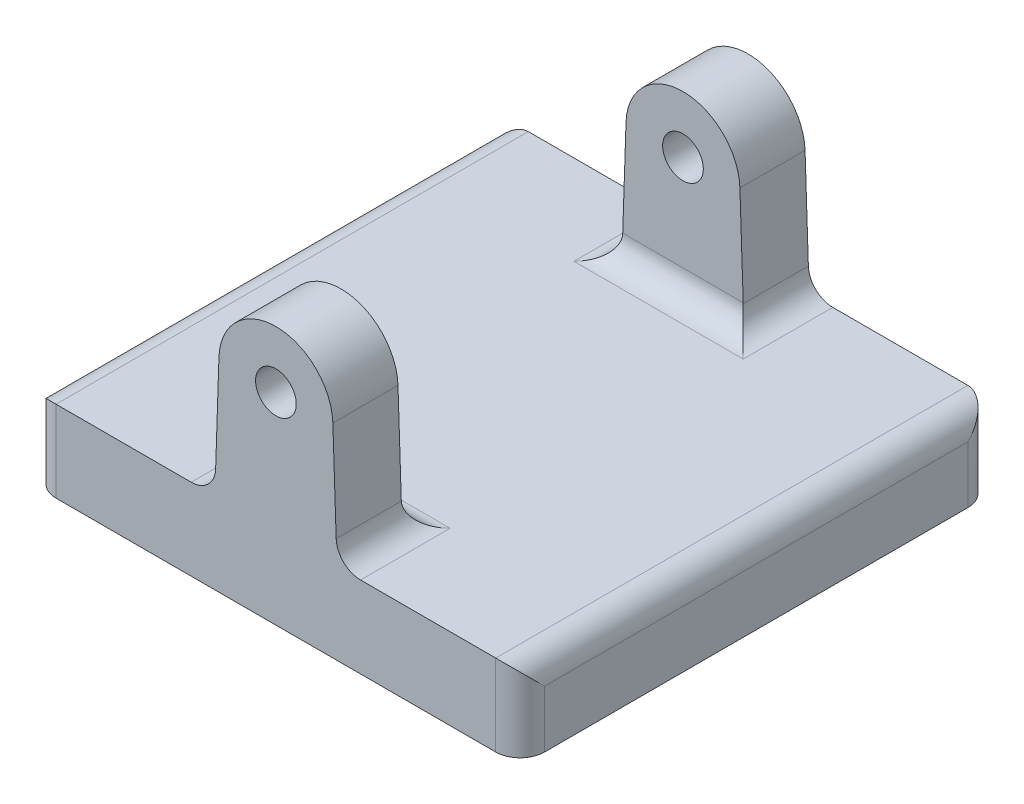
ISO-10303-21;
HEADER;
FILE_DESCRIPTION(('STEP AP214'),'2;1');
FILE_NAME('part.step','',(''),(''),'','','');
FILE_SCHEMA(('AUTOMOTIVE_DESIGN { 1 0 10303 214 1 1 1 1 }'));
ENDSEC;
DATA;
#1=APPLICATION_CONTEXT('core data for automotive mechanical design processes');
#2=APPLICATION_PROTOCOL_DEFINITION('international standard','automotive_design',2000,#1);
#3=PRODUCT_CONTEXT('',#1,'mechanical');
#4=PRODUCT('Part','Part','',(#3));
#5=PRODUCT_RELATED_PRODUCT_CATEGORY('part','',(#4));
#6=PRODUCT_DEFINITION_FORMATION('','',#4);
#7=PRODUCT_DEFINITION_CONTEXT('part definition',#1,'design');
#8=PRODUCT_DEFINITION('design','',#6,#7);
#9=PRODUCT_DEFINITION_SHAPE('','',#8);
#10=(LENGTH_UNIT() NAMED_UNIT(*) SI_UNIT(.MILLI.,.METRE.));
#11=(NAMED_UNIT(*) PLANE_ANGLE_UNIT() SI_UNIT($,.RADIAN.));
#12=(NAMED_UNIT(*) SI_UNIT($,.STERADIAN.) SOLID_ANGLE_UNIT());
#13=UNCERTAINTY_MEASURE_WITH_UNIT(LENGTH_MEASURE(1.E-05),#10,'distance_accuracy_value','');
#14=(GEOMETRIC_REPRESENTATION_CONTEXT(3) GLOBAL_UNCERTAINTY_ASSIGNED_CONTEXT((#13)) GLOBAL_UNIT_ASSIGNED_CONTEXT((#10,
#11,#12)) REPRESENTATION_CONTEXT('',''));
#15=CARTESIAN_POINT('',(0.,0.,0.));
#16=DIRECTION('',(0.,0.,1.));
#17=DIRECTION('',(1.,0.,0.));
#18=AXIS2_PLACEMENT_3D('',#15,#16,#17);
#19=CARTESIAN_POINT('',(0.,10.,0.));
#20=DIRECTION('',(0.,-1.,0.));
#21=DIRECTION('',(0.,0.,-1.));
#22=AXIS2_PLACEMENT_3D('',#19,#20,#21);
#23=PLANE('',#22);
#24=DIRECTION('',(1.,0.,0.));
#25=VECTOR('',#24,1.);
#26=CARTESIAN_POINT('',(-30.,10.,29.));
#27=LINE('',#26,#25);
#28=CARTESIAN_POINT('',(-27.,10.,29.));
#29=VERTEX_POINT('',#28);
#30=CARTESIAN_POINT('',(-10.4009031694853,10.,29.));
#31=VERTEX_POINT('',#30);
#32=EDGE_CURVE('E262',#29,#31,#27,.T.);
#33=ORIENTED_EDGE('',*,*,#32,.T.);
#34=DIRECTION('',(0.,0.,1.));
#35=VECTOR('',#34,1.);
#36=CARTESIAN_POINT('',(-10.4009031694853,10.,0.));
#37=LINE('',#36,#35);
#38=CARTESIAN_POINT('',(-10.4009031694853,10.,18.));
#39=VERTEX_POINT('',#38);
#40=EDGE_CURVE('E323',#31,#39,#37,.F.);
#41=ORIENTED_EDGE('',*,*,#40,.T.);
#42=DIRECTION('',(1.,0.,0.));
#43=VECTOR('',#42,1.);
#44=CARTESIAN_POINT('',(0.,10.,18.));
#45=LINE('',#44,#43);
#46=CARTESIAN_POINT('',(10.4009031694853,10.,18.));
#47=VERTEX_POINT('',#46);
#48=EDGE_CURVE('E320',#39,#47,#45,.T.);
#49=ORIENTED_EDGE('',*,*,#48,.T.);
#50=DIRECTION('',(0.,0.,1.));
#51=VECTOR('',#50,1.);
#52=CARTESIAN_POINT('',(10.4009031694853,10.,0.));
#53=LINE('',#52,#51);
#54=CARTESIAN_POINT('',(10.4009031694853,10.,29.));
#55=VERTEX_POINT('',#54);
#56=EDGE_CURVE('E318',#47,#55,#53,.T.);
#57=ORIENTED_EDGE('',*,*,#56,.T.);
#58=CARTESIAN_POINT('',(27.,10.,29.));
#59=VERTEX_POINT('',#58);
#60=EDGE_CURVE('E260',#55,#59,#27,.T.);
#61=ORIENTED_EDGE('',*,*,#60,.T.);
#62=DIRECTION('',(0.,0.,-1.));
#63=VECTOR('',#62,1.);
#64=CARTESIAN_POINT('',(27.,10.,0.));
#65=LINE('',#64,#63);
#66=CARTESIAN_POINT('',(27.,10.,-29.));
#67=VERTEX_POINT('',#66);
#68=EDGE_CURVE('E308',#59,#67,#65,.T.);
#69=ORIENTED_EDGE('',*,*,#68,.T.);
#70=DIRECTION('',(-1.,0.,0.));
#71=VECTOR('',#70,1.);
#72=CARTESIAN_POINT('',(-30.,10.,-29.));
#73=LINE('',#72,#71);
#74=CARTESIAN_POINT('',(10.4009031694853,10.,-29.));
#75=VERTEX_POINT('',#74);
#76=EDGE_CURVE('E257',#67,#75,#73,.T.);
#77=ORIENTED_EDGE('',*,*,#76,.T.);
#78=DIRECTION('',(0.,0.,-1.));
#79=VECTOR('',#78,1.);
#80=CARTESIAN_POINT('',(10.4009031694853,10.,-21.));
#81=LINE('',#80,#79);
#82=CARTESIAN_POINT('',(10.4009031694853,10.,-18.));
#83=VERTEX_POINT('',#82);
#84=EDGE_CURVE('E312',#75,#83,#81,.F.);
#85=ORIENTED_EDGE('',*,*,#84,.T.);
#86=DIRECTION('',(1.,0.,0.));
#87=VECTOR('',#86,1.);
#88=CARTESIAN_POINT('',(0.,10.,-18.));
#89=LINE('',#88,#87);
#90=CARTESIAN_POINT('',(-10.4009031694853,10.,-18.));
#91=VERTEX_POINT('',#90);
#92=EDGE_CURVE('E314',#83,#91,#89,.F.);
#93=ORIENTED_EDGE('',*,*,#92,.T.);
#94=DIRECTION('',(0.,0.,-1.));
#95=VECTOR('',#94,1.);
#96=CARTESIAN_POINT('',(-10.4009031694853,10.,-29.));
#97=LINE('',#96,#95);
#98=CARTESIAN_POINT('',(-10.4009031694853,10.,-29.));
#99=VERTEX_POINT('',#98);
#100=EDGE_CURVE('E316',#91,#99,#97,.T.);
#101=ORIENTED_EDGE('',*,*,#100,.T.);
#102=CARTESIAN_POINT('',(-27.,10.,-29.));
#103=VERTEX_POINT('',#102);
#104=EDGE_CURVE('E261',#99,#103,#73,.T.);
#105=ORIENTED_EDGE('',*,*,#104,.T.);
#106=DIRECTION('',(0.,0.,1.));
#107=VECTOR('',#106,1.);
#108=CARTESIAN_POINT('',(-27.,10.,0.));
#109=LINE('',#108,#107);
#110=EDGE_CURVE('E310',#103,#29,#109,.T.);
#111=ORIENTED_EDGE('',*,*,#110,.T.);
#112=EDGE_LOOP('',(#33,#41,#49,#57,#61,#69,#77,#85,#93,#101,#105,#111));
#113=FACE_BOUND('',#112,.T.);
#114=ADVANCED_FACE('F37',(#113),#23,.F.);
#115=CARTESIAN_POINT('',(30.,10.,29.));
#116=DIRECTION('',(-1.,0.,0.));
#117=DIRECTION('',(0.,0.,1.));
#118=AXIS2_PLACEMENT_3D('',#115,#116,#117);
#119=PLANE('',#118);
#120=DIRECTION('',(0.,0.,-1.));
#121=VECTOR('',#120,1.);
#122=CARTESIAN_POINT('',(30.,7.,29.));
#123=LINE('',#122,#121);
#124=CARTESIAN_POINT('',(30.,7.,-26.));
#125=VERTEX_POINT('',#124);
#126=CARTESIAN_POINT('',(30.,7.,26.));
#127=VERTEX_POINT('',#126);
#128=EDGE_CURVE('E265',#125,#127,#123,.F.);
#129=ORIENTED_EDGE('',*,*,#128,.T.);
#130=DIRECTION('',(0.,-1.,0.));
#131=VECTOR('',#130,1.);
#132=CARTESIAN_POINT('',(30.,10.,26.));
#133=LINE('',#132,#131);
#134=CARTESIAN_POINT('',(30.,0.,26.));
#135=VERTEX_POINT('',#134);
#136=EDGE_CURVE('E280',#127,#135,#133,.T.);
#137=ORIENTED_EDGE('',*,*,#136,.T.);
#138=DIRECTION('',(0.,0.,-1.));
#139=VECTOR('',#138,1.);
#140=CARTESIAN_POINT('',(30.,0.,29.));
#141=LINE('',#140,#139);
#142=CARTESIAN_POINT('',(30.,0.,-26.));
#143=VERTEX_POINT('',#142);
#144=EDGE_CURVE('E254',#135,#143,#141,.T.);
#145=ORIENTED_EDGE('',*,*,#144,.T.);
#146=DIRECTION('',(0.,-1.,0.));
#147=VECTOR('',#146,1.);
#148=CARTESIAN_POINT('',(30.,10.,-26.));
#149=LINE('',#148,#147);
#150=EDGE_CURVE('E278',#143,#125,#149,.F.);
#151=ORIENTED_EDGE('',*,*,#150,.T.);
#152=EDGE_LOOP('',(#129,#137,#145,#151));
#153=FACE_BOUND('',#152,.T.);
#154=ADVANCED_FACE('F420',(#153),#119,.F.);
#155=CARTESIAN_POINT('',(-30.,10.,-29.));
#156=DIRECTION('',(0.,0.,1.));
#157=DIRECTION('',(1.,0.,0.));
#158=AXIS2_PLACEMENT_3D('',#155,#156,#157);
#159=PLANE('',#158);
#160=DIRECTION('',(-1.,0.,0.));
#161=VECTOR('',#160,1.);
#162=CARTESIAN_POINT('',(-30.,0.,-29.));
#163=LINE('',#162,#161);
#164=CARTESIAN_POINT('',(27.,0.,-29.));
#165=VERTEX_POINT('',#164);
#166=CARTESIAN_POINT('',(-27.,0.,-29.));
#167=VERTEX_POINT('',#166);
#168=EDGE_CURVE('E268',#165,#167,#163,.T.);
#169=ORIENTED_EDGE('',*,*,#168,.T.);
#170=DIRECTION('',(0.,-1.,0.));
#171=VECTOR('',#170,1.);
#172=CARTESIAN_POINT('',(-27.,10.,-29.));
#173=LINE('',#172,#171);
#174=EDGE_CURVE('E304',#167,#103,#173,.F.);
#175=ORIENTED_EDGE('',*,*,#174,.T.);
#176=ORIENTED_EDGE('',*,*,#104,.F.);
#177=CARTESIAN_POINT('',(-10.4009031694853,13.,-29.));
#178=DIRECTION('',(0.,0.,1.));
#179=DIRECTION('',(1.,0.,0.));
#180=AXIS2_PLACEMENT_3D('',#177,#178,#179);
#181=CIRCLE('',#180,3.);
#182=CARTESIAN_POINT('',(-7.40259482270454,12.8992673954235,-29.));
#183=VERTEX_POINT('',#182);
#184=EDGE_CURVE('E46',#99,#183,#181,.T.);
#185=ORIENTED_EDGE('',*,*,#184,.T.);
#186=DIRECTION('',(-0.0335775348588195,-0.99943611559359,0.));
#187=VECTOR('',#186,1.);
#188=CARTESIAN_POINT('',(-7.49999999999999,10.,-29.));
#189=LINE('',#188,#187);
#190=CARTESIAN_POINT('',(-6.99605280915513,25.,-29.));
#191=VERTEX_POINT('',#190);
#192=EDGE_CURVE('E224',#191,#183,#189,.T.);
#193=ORIENTED_EDGE('',*,*,#192,.F.);
#194=CARTESIAN_POINT('',(0.,24.7649572559883,-29.));
#195=DIRECTION('',(0.,0.,1.));
#196=DIRECTION('',(-1.,0.,0.));
#197=AXIS2_PLACEMENT_3D('',#194,#195,#196);
#198=CIRCLE('',#197,7.);
#199=CARTESIAN_POINT('',(6.99605280915514,25.,-29.));
#200=VERTEX_POINT('',#199);
#201=EDGE_CURVE('E207',#200,#191,#198,.T.);
#202=ORIENTED_EDGE('',*,*,#201,.F.);
#203=DIRECTION('',(-0.0335775348588197,0.99943611559359,0.));
#204=VECTOR('',#203,1.);
#205=CARTESIAN_POINT('',(6.99605280915514,25.,-29.));
#206=LINE('',#205,#204);
#207=CARTESIAN_POINT('',(7.40259482270455,12.8992673954235,-29.));
#208=VERTEX_POINT('',#207);
#209=EDGE_CURVE('E216',#208,#200,#206,.T.);
#210=ORIENTED_EDGE('',*,*,#209,.F.);
#211=CARTESIAN_POINT('',(10.4009031694853,13.,-29.));
#212=DIRECTION('',(0.,0.,1.));
#213=DIRECTION('',(1.,0.,0.));
#214=AXIS2_PLACEMENT_3D('',#211,#212,#213);
#215=CIRCLE('',#214,3.);
#216=EDGE_CURVE('E11',#208,#75,#215,.T.);
#217=ORIENTED_EDGE('',*,*,#216,.T.);
#218=ORIENTED_EDGE('',*,*,#76,.F.);
#219=DIRECTION('',(0.,-1.,0.));
#220=VECTOR('',#219,1.);
#221=CARTESIAN_POINT('',(27.,10.,-29.));
#222=LINE('',#221,#220);
#223=EDGE_CURVE('E302',#67,#165,#222,.T.);
#224=ORIENTED_EDGE('',*,*,#223,.T.);
#225=EDGE_LOOP('',(#169,#175,#176,#185,#193,#202,#210,#217,#218,#224));
#226=FACE_BOUND('',#225,.T.);
#227=CARTESIAN_POINT('',(0.,24.7649572559883,-29.));
#228=DIRECTION('',(0.,0.,1.));
#229=DIRECTION('',(1.,0.,0.));
#230=AXIS2_PLACEMENT_3D('',#227,#228,#229);
#231=CIRCLE('',#230,2.5);
#232=CARTESIAN_POINT('',(2.50000000000001,24.7649572559883,-29.));
#233=VERTEX_POINT('',#232);
#234=EDGE_CURVE('E220',#233,#233,#231,.T.);
#235=ORIENTED_EDGE('',*,*,#234,.T.);
#236=EDGE_LOOP('',(#235));
#237=FACE_BOUND('',#236,.T.);
#238=ADVANCED_FACE('F404',(#226,#237),#159,.F.);
#239=CARTESIAN_POINT('',(-30.,10.,29.));
#240=DIRECTION('',(1.,0.,0.));
#241=DIRECTION('',(0.,0.,-1.));
#242=AXIS2_PLACEMENT_3D('',#239,#240,#241);
#243=PLANE('',#242);
#244=DIRECTION('',(0.,0.,1.));
#245=VECTOR('',#244,1.);
#246=CARTESIAN_POINT('',(-30.,0.,29.));
#247=LINE('',#246,#245);
#248=CARTESIAN_POINT('',(-30.,0.,-26.));
#249=VERTEX_POINT('',#248);
#250=CARTESIAN_POINT('',(-30.,0.,26.));
#251=VERTEX_POINT('',#250);
#252=EDGE_CURVE('E271',#249,#251,#247,.T.);
#253=ORIENTED_EDGE('',*,*,#252,.T.);
#254=DIRECTION('',(0.,-1.,0.));
#255=VECTOR('',#254,1.);
#256=CARTESIAN_POINT('',(-30.,10.,26.));
#257=LINE('',#256,#255);
#258=CARTESIAN_POINT('',(-30.,7.,26.));
#259=VERTEX_POINT('',#258);
#260=EDGE_CURVE('E300',#251,#259,#257,.F.);
#261=ORIENTED_EDGE('',*,*,#260,.T.);
#262=DIRECTION('',(0.,0.,1.));
#263=VECTOR('',#262,1.);
#264=CARTESIAN_POINT('',(-30.,7.,29.));
#265=LINE('',#264,#263);
#266=CARTESIAN_POINT('',(-30.,7.,-26.));
#267=VERTEX_POINT('',#266);
#268=EDGE_CURVE('E296',#259,#267,#265,.F.);
#269=ORIENTED_EDGE('',*,*,#268,.T.);
#270=DIRECTION('',(0.,-1.,0.));
#271=VECTOR('',#270,1.);
#272=CARTESIAN_POINT('',(-30.,10.,-26.));
#273=LINE('',#272,#271);
#274=EDGE_CURVE('E298',#267,#249,#273,.T.);
#275=ORIENTED_EDGE('',*,*,#274,.T.);
#276=EDGE_LOOP('',(#253,#261,#269,#275));
#277=FACE_BOUND('',#276,.T.);
#278=ADVANCED_FACE('F395',(#277),#243,.F.);
#279=CARTESIAN_POINT('',(-30.,10.,29.));
#280=DIRECTION('',(0.,0.,-1.));
#281=DIRECTION('',(-1.,0.,0.));
#282=AXIS2_PLACEMENT_3D('',#279,#280,#281);
#283=PLANE('',#282);
#284=DIRECTION('',(1.,0.,0.));
#285=VECTOR('',#284,1.);
#286=CARTESIAN_POINT('',(-30.,0.,29.));
#287=LINE('',#286,#285);
#288=CARTESIAN_POINT('',(-27.,0.,29.));
#289=VERTEX_POINT('',#288);
#290=CARTESIAN_POINT('',(27.,0.,29.));
#291=VERTEX_POINT('',#290);
#292=EDGE_CURVE('E274',#289,#291,#287,.T.);
#293=ORIENTED_EDGE('',*,*,#292,.T.);
#294=DIRECTION('',(0.,-1.,0.));
#295=VECTOR('',#294,1.);
#296=CARTESIAN_POINT('',(27.,10.,29.));
#297=LINE('',#296,#295);
#298=EDGE_CURVE('E294',#291,#59,#297,.F.);
#299=ORIENTED_EDGE('',*,*,#298,.T.);
#300=ORIENTED_EDGE('',*,*,#60,.F.);
#301=CARTESIAN_POINT('',(10.4009031694853,13.,29.));
#302=DIRECTION('',(0.,0.,-1.));
#303=DIRECTION('',(-1.,0.,0.));
#304=AXIS2_PLACEMENT_3D('',#301,#302,#303);
#305=CIRCLE('',#304,3.);
#306=CARTESIAN_POINT('',(7.40259482270455,12.8992673954235,29.));
#307=VERTEX_POINT('',#306);
#308=EDGE_CURVE('E343',#55,#307,#305,.T.);
#309=ORIENTED_EDGE('',*,*,#308,.T.);
#310=DIRECTION('',(-0.0335775348588197,0.99943611559359,0.));
#311=VECTOR('',#310,1.);
#312=CARTESIAN_POINT('',(6.99605280915514,25.,29.));
#313=LINE('',#312,#311);
#314=CARTESIAN_POINT('',(6.99605280915514,25.,29.));
#315=VERTEX_POINT('',#314);
#316=EDGE_CURVE('E233',#307,#315,#313,.T.);
#317=ORIENTED_EDGE('',*,*,#316,.T.);
#318=CARTESIAN_POINT('',(0.,24.7649572559883,29.));
#319=DIRECTION('',(0.,0.,1.));
#320=DIRECTION('',(-1.,0.,0.));
#321=AXIS2_PLACEMENT_3D('',#318,#319,#320);
#322=CIRCLE('',#321,7.);
#323=CARTESIAN_POINT('',(-6.99605280915513,25.,29.));
#324=VERTEX_POINT('',#323);
#325=EDGE_CURVE('E247',#315,#324,#322,.T.);
#326=ORIENTED_EDGE('',*,*,#325,.T.);
#327=DIRECTION('',(-0.0335775348588195,-0.99943611559359,0.));
#328=VECTOR('',#327,1.);
#329=CARTESIAN_POINT('',(-7.49999999999999,10.,29.));
#330=LINE('',#329,#328);
#331=CARTESIAN_POINT('',(-7.40259482270454,12.8992673954235,29.));
#332=VERTEX_POINT('',#331);
#333=EDGE_CURVE('E239',#324,#332,#330,.T.);
#334=ORIENTED_EDGE('',*,*,#333,.T.);
#335=CARTESIAN_POINT('',(-10.4009031694853,13.,29.));
#336=DIRECTION('',(0.,0.,-1.));
#337=DIRECTION('',(-1.,0.,0.));
#338=AXIS2_PLACEMENT_3D('',#335,#336,#337);
#339=CIRCLE('',#338,3.);
#340=EDGE_CURVE('E341',#332,#31,#339,.T.);
#341=ORIENTED_EDGE('',*,*,#340,.T.);
#342=ORIENTED_EDGE('',*,*,#32,.F.);
#343=DIRECTION('',(0.,-1.,0.));
#344=VECTOR('',#343,1.);
#345=CARTESIAN_POINT('',(-27.,10.,29.));
#346=LINE('',#345,#344);
#347=EDGE_CURVE('E291',#29,#289,#346,.T.);
#348=ORIENTED_EDGE('',*,*,#347,.T.);
#349=EDGE_LOOP('',(#293,#299,#300,#309,#317,#326,#334,#341,#342,#348));
#350=FACE_BOUND('',#349,.T.);
#351=CARTESIAN_POINT('',(0.,24.7649572559883,29.));
#352=DIRECTION('',(0.,0.,1.));
#353=DIRECTION('',(1.,0.,0.));
#354=AXIS2_PLACEMENT_3D('',#351,#352,#353);
#355=CIRCLE('',#354,2.5);
#356=CARTESIAN_POINT('',(2.50000000000001,24.7649572559883,29.));
#357=VERTEX_POINT('',#356);
#358=EDGE_CURVE('E228',#357,#357,#355,.T.);
#359=ORIENTED_EDGE('',*,*,#358,.F.);
#360=EDGE_LOOP('',(#359));
#361=FACE_BOUND('',#360,.T.);
#362=ADVANCED_FACE('F379',(#350,#361),#283,.F.);
#363=CARTESIAN_POINT('',(0.,0.,0.));
#364=DIRECTION('',(0.,-1.,0.));
#365=DIRECTION('',(0.,0.,-1.));
#366=AXIS2_PLACEMENT_3D('',#363,#364,#365);
#367=PLANE('',#366);
#368=ORIENTED_EDGE('',*,*,#144,.F.);
#369=CARTESIAN_POINT('',(27.,0.,26.));
#370=DIRECTION('',(0.,-1.,0.));
#371=DIRECTION('',(0.,0.,-1.));
#372=AXIS2_PLACEMENT_3D('',#369,#370,#371);
#373=CIRCLE('',#372,3.);
#374=EDGE_CURVE('E289',#135,#291,#373,.T.);
#375=ORIENTED_EDGE('',*,*,#374,.T.);
#376=ORIENTED_EDGE('',*,*,#292,.F.);
#377=CARTESIAN_POINT('',(-27.,0.,26.));
#378=DIRECTION('',(0.,-1.,0.));
#379=DIRECTION('',(0.,0.,-1.));
#380=AXIS2_PLACEMENT_3D('',#377,#378,#379);
#381=CIRCLE('',#380,3.);
#382=EDGE_CURVE('E287',#289,#251,#381,.T.);
#383=ORIENTED_EDGE('',*,*,#382,.T.);
#384=ORIENTED_EDGE('',*,*,#252,.F.);
#385=CARTESIAN_POINT('',(-27.,0.,-26.));
#386=DIRECTION('',(0.,-1.,0.));
#387=DIRECTION('',(0.,0.,-1.));
#388=AXIS2_PLACEMENT_3D('',#385,#386,#387);
#389=CIRCLE('',#388,3.);
#390=EDGE_CURVE('E285',#249,#167,#389,.T.);
#391=ORIENTED_EDGE('',*,*,#390,.T.);
#392=ORIENTED_EDGE('',*,*,#168,.F.);
#393=CARTESIAN_POINT('',(27.,0.,-26.));
#394=DIRECTION('',(0.,-1.,0.));
#395=DIRECTION('',(0.,0.,-1.));
#396=AXIS2_PLACEMENT_3D('',#393,#394,#395);
#397=CIRCLE('',#396,3.);
#398=EDGE_CURVE('E283',#165,#143,#397,.T.);
#399=ORIENTED_EDGE('',*,*,#398,.T.);
#400=EDGE_LOOP('',(#368,#375,#376,#383,#384,#391,#392,#399));
#401=FACE_BOUND('',#400,.T.);
#402=ADVANCED_FACE('F392',(#401),#367,.T.);
#403=CARTESIAN_POINT('',(-7.49999999999999,10.,21.));
#404=DIRECTION('',(-0.99943611559359,0.0335775348588195,0.));
#405=DIRECTION('',(-0.0335775348588195,-0.99943611559359,0.));
#406=AXIS2_PLACEMENT_3D('',#403,#404,#405);
#407=PLANE('',#406);
#408=CARTESIAN_POINT('',(-7.39921056183102,13.,18.));
#409=DIRECTION('',(-0.99943611559359,0.0335775348588195,0.));
#410=DIRECTION('',(0.0335775348588195,0.99943611559359,0.));
#411=AXIS2_PLACEMENT_3D('',#408,#409,#410);
#412=ELLIPSE('',#411,3.00169260765429,3.);
#413=CARTESIAN_POINT('',(-7.39921056183102,13.,21.));
#414=VERTEX_POINT('',#413);
#415=CARTESIAN_POINT('',(-7.40259482270454,12.8992673954235,20.9983083467808));
#416=VERTEX_POINT('',#415);
#417=EDGE_CURVE('E339',#414,#416,#412,.F.);
#418=ORIENTED_EDGE('',*,*,#417,.T.);
#419=DIRECTION('',(0.,0.,1.));
#420=VECTOR('',#419,1.);
#421=CARTESIAN_POINT('',(-7.40259482270454,12.8992673954235,21.));
#422=LINE('',#421,#420);
#423=EDGE_CURVE('E54',#416,#332,#422,.T.);
#424=ORIENTED_EDGE('',*,*,#423,.T.);
#425=ORIENTED_EDGE('',*,*,#333,.F.);
#426=DIRECTION('',(0.,0.,1.));
#427=VECTOR('',#426,1.);
#428=CARTESIAN_POINT('',(-6.99605280915513,25.,21.));
#429=LINE('',#428,#427);
#430=CARTESIAN_POINT('',(-6.99605280915513,25.,21.));
#431=VERTEX_POINT('',#430);
#432=EDGE_CURVE('E252',#431,#324,#429,.T.);
#433=ORIENTED_EDGE('',*,*,#432,.F.);
#434=DIRECTION('',(-0.0335775348588195,-0.99943611559359,0.));
#435=VECTOR('',#434,1.);
#436=CARTESIAN_POINT('',(-7.49999999999999,10.,21.));
#437=LINE('',#436,#435);
#438=EDGE_CURVE('E242',#431,#414,#437,.T.);
#439=ORIENTED_EDGE('',*,*,#438,.T.);
#440=EDGE_LOOP('',(#418,#424,#425,#433,#439));
#441=FACE_BOUND('',#440,.T.);
#442=ADVANCED_FACE('F446',(#441),#407,.T.);
#443=CARTESIAN_POINT('',(0.,24.7649572559883,21.));
#444=DIRECTION('',(0.,0.,1.));
#445=DIRECTION('',(1.,0.,0.));
#446=AXIS2_PLACEMENT_3D('',#443,#444,#445);
#447=CYLINDRICAL_SURFACE('',#446,7.);
#448=ORIENTED_EDGE('',*,*,#325,.F.);
#449=DIRECTION('',(0.,0.,1.));
#450=VECTOR('',#449,1.);
#451=CARTESIAN_POINT('',(6.99605280915514,25.,21.));
#452=LINE('',#451,#450);
#453=CARTESIAN_POINT('',(6.99605280915514,25.,21.));
#454=VERTEX_POINT('',#453);
#455=EDGE_CURVE('E245',#454,#315,#452,.T.);
#456=ORIENTED_EDGE('',*,*,#455,.F.);
#457=CARTESIAN_POINT('',(0.,24.7649572559883,21.));
#458=DIRECTION('',(0.,0.,1.));
#459=DIRECTION('',(-1.,0.,0.));
#460=AXIS2_PLACEMENT_3D('',#457,#458,#459);
#461=CIRCLE('',#460,7.);
#462=EDGE_CURVE('E238',#454,#431,#461,.T.);
#463=ORIENTED_EDGE('',*,*,#462,.T.);
#464=ORIENTED_EDGE('',*,*,#432,.T.);
#465=EDGE_LOOP('',(#448,#456,#463,#464));
#466=FACE_BOUND('',#465,.T.);
#467=ADVANCED_FACE('F474',(#466),#447,.T.);
#468=CARTESIAN_POINT('',(6.99605280915514,25.,21.));
#469=DIRECTION('',(0.99943611559359,0.0335775348588197,0.));
#470=DIRECTION('',(-0.0335775348588197,0.99943611559359,0.));
#471=AXIS2_PLACEMENT_3D('',#468,#469,#470);
#472=PLANE('',#471);
#473=ORIENTED_EDGE('',*,*,#316,.F.);
#474=DIRECTION('',(0.,0.,1.));
#475=VECTOR('',#474,1.);
#476=CARTESIAN_POINT('',(7.40259482270455,12.8992673954235,21.));
#477=LINE('',#476,#475);
#478=CARTESIAN_POINT('',(7.40259482270455,12.8992673954235,20.9983083467808));
#479=VERTEX_POINT('',#478);
#480=EDGE_CURVE('E62',#307,#479,#477,.F.);
#481=ORIENTED_EDGE('',*,*,#480,.T.);
#482=CARTESIAN_POINT('',(7.39921056183103,13.,18.));
#483=DIRECTION('',(0.99943611559359,0.0335775348588197,0.));
#484=DIRECTION('',(0.0335775348588197,-0.99943611559359,0.));
#485=AXIS2_PLACEMENT_3D('',#482,#483,#484);
#486=ELLIPSE('',#485,3.00169260765429,3.);
#487=CARTESIAN_POINT('',(7.39921056183103,13.,21.));
#488=VERTEX_POINT('',#487);
#489=EDGE_CURVE('E337',#479,#488,#486,.F.);
#490=ORIENTED_EDGE('',*,*,#489,.T.);
#491=DIRECTION('',(-0.0335775348588197,0.99943611559359,0.));
#492=VECTOR('',#491,1.);
#493=CARTESIAN_POINT('',(6.99605280915514,25.,21.));
#494=LINE('',#493,#492);
#495=EDGE_CURVE('E236',#488,#454,#494,.T.);
#496=ORIENTED_EDGE('',*,*,#495,.T.);
#497=ORIENTED_EDGE('',*,*,#455,.T.);
#498=EDGE_LOOP('',(#473,#481,#490,#496,#497));
#499=FACE_BOUND('',#498,.T.);
#500=ADVANCED_FACE('F442',(#499),#472,.T.);
#501=CARTESIAN_POINT('',(0.,24.7649572559883,21.));
#502=DIRECTION('',(0.,0.,-1.));
#503=DIRECTION('',(-1.,0.,0.));
#504=AXIS2_PLACEMENT_3D('',#501,#502,#503);
#505=PLANE('',#504);
#506=CARTESIAN_POINT('',(0.,24.7649572559883,21.));
#507=DIRECTION('',(0.,0.,1.));
#508=DIRECTION('',(1.,0.,0.));
#509=AXIS2_PLACEMENT_3D('',#506,#507,#508);
#510=CIRCLE('',#509,2.5);
#511=CARTESIAN_POINT('',(2.50000000000001,24.7649572559883,21.));
#512=VERTEX_POINT('',#511);
#513=EDGE_CURVE('E230',#512,#512,#510,.T.);
#514=ORIENTED_EDGE('',*,*,#513,.T.);
#515=EDGE_LOOP('',(#514));
#516=FACE_BOUND('',#515,.T.);
#517=ORIENTED_EDGE('',*,*,#495,.F.);
#518=DIRECTION('',(1.,0.,0.));
#519=VECTOR('',#518,1.);
#520=CARTESIAN_POINT('',(0.,13.,21.));
#521=LINE('',#520,#519);
#522=EDGE_CURVE('E325',#488,#414,#521,.F.);
#523=ORIENTED_EDGE('',*,*,#522,.T.);
#524=ORIENTED_EDGE('',*,*,#438,.F.);
#525=ORIENTED_EDGE('',*,*,#462,.F.);
#526=EDGE_LOOP('',(#517,#523,#524,#525));
#527=FACE_BOUND('',#526,.T.);
#528=ADVANCED_FACE('F489',(#516,#527),#505,.T.);
#529=CARTESIAN_POINT('',(0.,24.7649572559883,21.));
#530=DIRECTION('',(0.,0.,1.));
#531=DIRECTION('',(1.,0.,0.));
#532=AXIS2_PLACEMENT_3D('',#529,#530,#531);
#533=CYLINDRICAL_SURFACE('',#532,2.5);
#534=ORIENTED_EDGE('',*,*,#513,.F.);
#535=EDGE_LOOP('',(#534));
#536=FACE_BOUND('',#535,.T.);
#537=ORIENTED_EDGE('',*,*,#358,.T.);
#538=EDGE_LOOP('',(#537));
#539=FACE_BOUND('',#538,.T.);
#540=ADVANCED_FACE('F495',(#536,#539),#533,.F.);
#541=CARTESIAN_POINT('',(0.,24.7649572559883,-21.));
#542=DIRECTION('',(0.,0.,1.));
#543=DIRECTION('',(-1.,0.,0.));
#544=AXIS2_PLACEMENT_3D('',#541,#542,#543);
#545=PLANE('',#544);
#546=DIRECTION('',(-0.0335775348588195,-0.99943611559359,0.));
#547=VECTOR('',#546,1.);
#548=CARTESIAN_POINT('',(-7.49999999999999,10.,-21.));
#549=LINE('',#548,#547);
#550=CARTESIAN_POINT('',(-6.99605280915513,25.,-21.));
#551=VERTEX_POINT('',#550);
#552=CARTESIAN_POINT('',(-7.39921056183102,13.,-21.));
#553=VERTEX_POINT('',#552);
#554=EDGE_CURVE('E195',#551,#553,#549,.T.);
#555=ORIENTED_EDGE('',*,*,#554,.T.);
#556=DIRECTION('',(1.,0.,0.));
#557=VECTOR('',#556,1.);
#558=CARTESIAN_POINT('',(0.,13.,-21.));
#559=LINE('',#558,#557);
#560=CARTESIAN_POINT('',(7.39921056183103,13.,-21.));
#561=VERTEX_POINT('',#560);
#562=EDGE_CURVE('E306',#553,#561,#559,.T.);
#563=ORIENTED_EDGE('',*,*,#562,.T.);
#564=DIRECTION('',(-0.0335775348588197,0.99943611559359,0.));
#565=VECTOR('',#564,1.);
#566=CARTESIAN_POINT('',(6.99605280915514,25.,-21.));
#567=LINE('',#566,#565);
#568=CARTESIAN_POINT('',(6.99605280915514,25.,-21.));
#569=VERTEX_POINT('',#568);
#570=EDGE_CURVE('E198',#561,#569,#567,.T.);
#571=ORIENTED_EDGE('',*,*,#570,.T.);
#572=CARTESIAN_POINT('',(0.,24.7649572559883,-21.));
#573=DIRECTION('',(0.,0.,1.));
#574=DIRECTION('',(-1.,0.,0.));
#575=AXIS2_PLACEMENT_3D('',#572,#573,#574);
#576=CIRCLE('',#575,7.);
#577=EDGE_CURVE('E189',#569,#551,#576,.T.);
#578=ORIENTED_EDGE('',*,*,#577,.T.);
#579=EDGE_LOOP('',(#555,#563,#571,#578));
#580=FACE_BOUND('',#579,.T.);
#581=CARTESIAN_POINT('',(0.,24.7649572559883,-21.));
#582=DIRECTION('',(0.,0.,1.));
#583=DIRECTION('',(1.,0.,0.));
#584=AXIS2_PLACEMENT_3D('',#581,#582,#583);
#585=CIRCLE('',#584,2.5);
#586=CARTESIAN_POINT('',(2.50000000000001,24.7649572559883,-21.));
#587=VERTEX_POINT('',#586);
#588=EDGE_CURVE('E226',#587,#587,#585,.T.);
#589=ORIENTED_EDGE('',*,*,#588,.F.);
#590=EDGE_LOOP('',(#589));
#591=FACE_BOUND('',#590,.T.);
#592=ADVANCED_FACE('F191',(#580,#591),#545,.T.);
#593=CARTESIAN_POINT('',(6.99605280915514,25.,-21.));
#594=DIRECTION('',(-0.99943611559359,-0.0335775348588197,0.));
#595=DIRECTION('',(0.0335775348588197,-0.99943611559359,0.));
#596=AXIS2_PLACEMENT_3D('',#593,#594,#595);
#597=PLANE('',#596);
#598=CARTESIAN_POINT('',(7.39921056183103,13.,-18.));
#599=DIRECTION('',(-0.99943611559359,-0.0335775348588197,0.));
#600=DIRECTION('',(0.0335775348588197,-0.99943611559359,0.));
#601=AXIS2_PLACEMENT_3D('',#598,#599,#600);
#602=ELLIPSE('',#601,3.00169260765429,3.);
#603=CARTESIAN_POINT('',(7.40259482270455,12.8992673954235,-20.9983083467808));
#604=VERTEX_POINT('',#603);
#605=EDGE_CURVE('E333',#561,#604,#602,.T.);
#606=ORIENTED_EDGE('',*,*,#605,.T.);
#607=DIRECTION('',(0.,0.,-1.));
#608=VECTOR('',#607,1.);
#609=CARTESIAN_POINT('',(7.40259482270455,12.8992673954235,-29.));
#610=LINE('',#609,#608);
#611=EDGE_CURVE('E331',#604,#208,#610,.T.);
#612=ORIENTED_EDGE('',*,*,#611,.T.);
#613=ORIENTED_EDGE('',*,*,#209,.T.);
#614=DIRECTION('',(0.,0.,-1.));
#615=VECTOR('',#614,1.);
#616=CARTESIAN_POINT('',(6.99605280915514,25.,-21.));
#617=LINE('',#616,#615);
#618=EDGE_CURVE('E211',#569,#200,#617,.T.);
#619=ORIENTED_EDGE('',*,*,#618,.F.);
#620=ORIENTED_EDGE('',*,*,#570,.F.);
#621=EDGE_LOOP('',(#606,#612,#613,#619,#620));
#622=FACE_BOUND('',#621,.T.);
#623=ADVANCED_FACE('F510',(#622),#597,.F.);
#624=CARTESIAN_POINT('',(0.,24.7649572559883,-21.));
#625=DIRECTION('',(0.,0.,-1.));
#626=DIRECTION('',(-1.,0.,0.));
#627=AXIS2_PLACEMENT_3D('',#624,#625,#626);
#628=CYLINDRICAL_SURFACE('',#627,7.);
#629=ORIENTED_EDGE('',*,*,#201,.T.);
#630=DIRECTION('',(0.,0.,-1.));
#631=VECTOR('',#630,1.);
#632=CARTESIAN_POINT('',(-6.99605280915513,25.,-21.));
#633=LINE('',#632,#631);
#634=EDGE_CURVE('E204',#551,#191,#633,.T.);
#635=ORIENTED_EDGE('',*,*,#634,.F.);
#636=ORIENTED_EDGE('',*,*,#577,.F.);
#637=ORIENTED_EDGE('',*,*,#618,.T.);
#638=EDGE_LOOP('',(#629,#635,#636,#637));
#639=FACE_BOUND('',#638,.T.);
#640=ADVANCED_FACE('F205',(#639),#628,.T.);
#641=CARTESIAN_POINT('',(-7.49999999999999,10.,-21.));
#642=DIRECTION('',(0.99943611559359,-0.0335775348588195,0.));
#643=DIRECTION('',(0.0335775348588195,0.99943611559359,0.));
#644=AXIS2_PLACEMENT_3D('',#641,#642,#643);
#645=PLANE('',#644);
#646=ORIENTED_EDGE('',*,*,#192,.T.);
#647=DIRECTION('',(0.,0.,-1.));
#648=VECTOR('',#647,1.);
#649=CARTESIAN_POINT('',(-7.40259482270454,12.8992673954235,-21.));
#650=LINE('',#649,#648);
#651=CARTESIAN_POINT('',(-7.40259482270454,12.8992673954235,-20.9983083467808));
#652=VERTEX_POINT('',#651);
#653=EDGE_CURVE('E329',#183,#652,#650,.F.);
#654=ORIENTED_EDGE('',*,*,#653,.T.);
#655=CARTESIAN_POINT('',(-7.39921056183102,13.,-18.));
#656=DIRECTION('',(0.99943611559359,-0.0335775348588195,0.));
#657=DIRECTION('',(0.0335775348588195,0.99943611559359,0.));
#658=AXIS2_PLACEMENT_3D('',#655,#656,#657);
#659=ELLIPSE('',#658,3.00169260765429,3.);
#660=EDGE_CURVE('E215',#652,#553,#659,.T.);
#661=ORIENTED_EDGE('',*,*,#660,.T.);
#662=ORIENTED_EDGE('',*,*,#554,.F.);
#663=ORIENTED_EDGE('',*,*,#634,.T.);
#664=EDGE_LOOP('',(#646,#654,#661,#662,#663));
#665=FACE_BOUND('',#664,.T.);
#666=ADVANCED_FACE('F213',(#665),#645,.F.);
#667=CARTESIAN_POINT('',(0.,24.7649572559883,-21.));
#668=DIRECTION('',(0.,0.,-1.));
#669=DIRECTION('',(-1.,0.,0.));
#670=AXIS2_PLACEMENT_3D('',#667,#668,#669);
#671=CYLINDRICAL_SURFACE('',#670,2.5);
#672=ORIENTED_EDGE('',*,*,#588,.T.);
#673=EDGE_LOOP('',(#672));
#674=FACE_BOUND('',#673,.T.);
#675=ORIENTED_EDGE('',*,*,#234,.F.);
#676=EDGE_LOOP('',(#675));
#677=FACE_BOUND('',#676,.T.);
#678=ADVANCED_FACE('F530',(#674,#677),#671,.F.);
#679=CARTESIAN_POINT('',(27.,10.,-26.));
#680=DIRECTION('',(0.,-1.,0.));
#681=DIRECTION('',(0.,0.,-1.));
#682=AXIS2_PLACEMENT_3D('',#679,#680,#681);
#683=CYLINDRICAL_SURFACE('',#682,3.);
#684=ORIENTED_EDGE('',*,*,#398,.F.);
#685=ORIENTED_EDGE('',*,*,#223,.F.);
#686=CARTESIAN_POINT('',(27.,7.,-26.));
#687=DIRECTION('',(0.,-0.707106781186547,-0.707106781186547));
#688=DIRECTION('',(0.,0.707106781186547,-0.707106781186547));
#689=AXIS2_PLACEMENT_3D('',#686,#687,#688);
#690=ELLIPSE('',#689,4.24264068711928,3.);
#691=EDGE_CURVE('E349',#125,#67,#690,.F.);
#692=ORIENTED_EDGE('',*,*,#691,.F.);
#693=ORIENTED_EDGE('',*,*,#150,.F.);
#694=EDGE_LOOP('',(#684,#685,#692,#693));
#695=FACE_BOUND('',#694,.T.);
#696=ADVANCED_FACE('F411',(#695),#683,.T.);
#697=CARTESIAN_POINT('',(27.,7.,0.));
#698=DIRECTION('',(0.,0.,-1.));
#699=DIRECTION('',(-1.,0.,0.));
#700=AXIS2_PLACEMENT_3D('',#697,#698,#699);
#701=CYLINDRICAL_SURFACE('',#700,3.);
#702=ORIENTED_EDGE('',*,*,#691,.T.);
#703=ORIENTED_EDGE('',*,*,#68,.F.);
#704=CARTESIAN_POINT('',(27.,7.,26.));
#705=DIRECTION('',(0.,0.707106781186547,-0.707106781186547));
#706=DIRECTION('',(0.,-0.707106781186547,-0.707106781186547));
#707=AXIS2_PLACEMENT_3D('',#704,#705,#706);
#708=ELLIPSE('',#707,4.24264068711928,3.);
#709=EDGE_CURVE('E346',#127,#59,#708,.F.);
#710=ORIENTED_EDGE('',*,*,#709,.F.);
#711=ORIENTED_EDGE('',*,*,#128,.F.);
#712=EDGE_LOOP('',(#702,#703,#710,#711));
#713=FACE_BOUND('',#712,.T.);
#714=ADVANCED_FACE('F416',(#713),#701,.T.);
#715=CARTESIAN_POINT('',(27.,10.,26.));
#716=DIRECTION('',(0.,-1.,0.));
#717=DIRECTION('',(0.,0.,-1.));
#718=AXIS2_PLACEMENT_3D('',#715,#716,#717);
#719=CYLINDRICAL_SURFACE('',#718,3.);
#720=ORIENTED_EDGE('',*,*,#709,.T.);
#721=ORIENTED_EDGE('',*,*,#298,.F.);
#722=ORIENTED_EDGE('',*,*,#374,.F.);
#723=ORIENTED_EDGE('',*,*,#136,.F.);
#724=EDGE_LOOP('',(#720,#721,#722,#723));
#725=FACE_BOUND('',#724,.T.);
#726=ADVANCED_FACE('F425',(#725),#719,.T.);
#727=CARTESIAN_POINT('',(-27.,10.,-26.));
#728=DIRECTION('',(0.,-1.,0.));
#729=DIRECTION('',(0.,0.,-1.));
#730=AXIS2_PLACEMENT_3D('',#727,#728,#729);
#731=CYLINDRICAL_SURFACE('',#730,3.);
#732=ORIENTED_EDGE('',*,*,#390,.F.);
#733=ORIENTED_EDGE('',*,*,#274,.F.);
#734=CARTESIAN_POINT('',(-27.,7.,-26.));
#735=DIRECTION('',(0.,0.707106781186547,0.707106781186547));
#736=DIRECTION('',(0.,-0.707106781186547,0.707106781186547));
#737=AXIS2_PLACEMENT_3D('',#734,#735,#736);
#738=ELLIPSE('',#737,4.24264068711928,3.);
#739=EDGE_CURVE('E350',#103,#267,#738,.T.);
#740=ORIENTED_EDGE('',*,*,#739,.F.);
#741=ORIENTED_EDGE('',*,*,#174,.F.);
#742=EDGE_LOOP('',(#732,#733,#740,#741));
#743=FACE_BOUND('',#742,.T.);
#744=ADVANCED_FACE('F399',(#743),#731,.T.);
#745=CARTESIAN_POINT('',(-27.,7.,0.));
#746=DIRECTION('',(0.,0.,1.));
#747=DIRECTION('',(1.,0.,0.));
#748=AXIS2_PLACEMENT_3D('',#745,#746,#747);
#749=CYLINDRICAL_SURFACE('',#748,3.);
#750=ORIENTED_EDGE('',*,*,#739,.T.);
#751=ORIENTED_EDGE('',*,*,#268,.F.);
#752=CARTESIAN_POINT('',(-27.,7.,26.));
#753=DIRECTION('',(0.,-0.707106781186547,0.707106781186547));
#754=DIRECTION('',(0.,0.707106781186547,0.707106781186547));
#755=AXIS2_PLACEMENT_3D('',#752,#753,#754);
#756=ELLIPSE('',#755,4.24264068711928,3.);
#757=EDGE_CURVE('E353',#29,#259,#756,.T.);
#758=ORIENTED_EDGE('',*,*,#757,.F.);
#759=ORIENTED_EDGE('',*,*,#110,.F.);
#760=EDGE_LOOP('',(#750,#751,#758,#759));
#761=FACE_BOUND('',#760,.T.);
#762=ADVANCED_FACE('F385',(#761),#749,.T.);
#763=CARTESIAN_POINT('',(-27.,10.,26.));
#764=DIRECTION('',(0.,-1.,0.));
#765=DIRECTION('',(0.,0.,-1.));
#766=AXIS2_PLACEMENT_3D('',#763,#764,#765);
#767=CYLINDRICAL_SURFACE('',#766,3.);
#768=ORIENTED_EDGE('',*,*,#757,.T.);
#769=ORIENTED_EDGE('',*,*,#260,.F.);
#770=ORIENTED_EDGE('',*,*,#382,.F.);
#771=ORIENTED_EDGE('',*,*,#347,.F.);
#772=EDGE_LOOP('',(#768,#769,#770,#771));
#773=FACE_BOUND('',#772,.T.);
#774=ADVANCED_FACE('F388',(#773),#767,.T.);
#775=CARTESIAN_POINT('',(-10.4009031694853,13.,0.));
#776=DIRECTION('',(0.,0.,1.));
#777=DIRECTION('',(1.,0.,0.));
#778=AXIS2_PLACEMENT_3D('',#775,#776,#777);
#779=CYLINDRICAL_SURFACE('',#778,3.);
#780=ORIENTED_EDGE('',*,*,#184,.F.);
#781=ORIENTED_EDGE('',*,*,#100,.F.);
#782=CARTESIAN_POINT('',(-10.4009031694853,13.,-18.));
#783=DIRECTION('',(0.707106781186547,0.,0.707106781186547));
#784=DIRECTION('',(-0.707106781186547,0.,0.707106781186547));
#785=AXIS2_PLACEMENT_3D('',#782,#783,#784);
#786=ELLIPSE('',#785,4.24264068711928,3.);
#787=EDGE_CURVE('E356',#652,#91,#786,.F.);
#788=ORIENTED_EDGE('',*,*,#787,.F.);
#789=ORIENTED_EDGE('',*,*,#653,.F.);
#790=EDGE_LOOP('',(#780,#781,#788,#789));
#791=FACE_BOUND('',#790,.T.);
#792=ADVANCED_FACE('F574',(#791),#779,.F.);
#793=CARTESIAN_POINT('',(10.4009031694853,13.,-21.));
#794=DIRECTION('',(0.,0.,1.));
#795=DIRECTION('',(1.,0.,0.));
#796=AXIS2_PLACEMENT_3D('',#793,#794,#795);
#797=CYLINDRICAL_SURFACE('',#796,3.);
#798=ORIENTED_EDGE('',*,*,#611,.F.);
#799=CARTESIAN_POINT('',(10.4009031694853,13.,-18.));
#800=DIRECTION('',(-0.707106781186547,0.,0.707106781186547));
#801=DIRECTION('',(0.707106781186547,0.,0.707106781186547));
#802=AXIS2_PLACEMENT_3D('',#799,#800,#801);
#803=ELLIPSE('',#802,4.24264068711928,3.);
#804=EDGE_CURVE('E359',#83,#604,#803,.F.);
#805=ORIENTED_EDGE('',*,*,#804,.F.);
#806=ORIENTED_EDGE('',*,*,#84,.F.);
#807=ORIENTED_EDGE('',*,*,#216,.F.);
#808=EDGE_LOOP('',(#798,#805,#806,#807));
#809=FACE_BOUND('',#808,.T.);
#810=ADVANCED_FACE('F583',(#809),#797,.F.);
#811=CARTESIAN_POINT('',(0.,13.,-18.));
#812=DIRECTION('',(1.,0.,0.));
#813=DIRECTION('',(0.,0.,-1.));
#814=AXIS2_PLACEMENT_3D('',#811,#812,#813);
#815=CYLINDRICAL_SURFACE('',#814,3.);
#816=ORIENTED_EDGE('',*,*,#787,.T.);
#817=ORIENTED_EDGE('',*,*,#92,.F.);
#818=ORIENTED_EDGE('',*,*,#804,.T.);
#819=ORIENTED_EDGE('',*,*,#605,.F.);
#820=ORIENTED_EDGE('',*,*,#562,.F.);
#821=ORIENTED_EDGE('',*,*,#660,.F.);
#822=EDGE_LOOP('',(#816,#817,#818,#819,#820,#821));
#823=FACE_BOUND('',#822,.T.);
#824=ADVANCED_FACE('F593',(#823),#815,.F.);
#825=CARTESIAN_POINT('',(-10.4009031694853,13.,21.));
#826=DIRECTION('',(0.,0.,1.));
#827=DIRECTION('',(1.,0.,0.));
#828=AXIS2_PLACEMENT_3D('',#825,#826,#827);
#829=CYLINDRICAL_SURFACE('',#828,3.);
#830=ORIENTED_EDGE('',*,*,#423,.F.);
#831=CARTESIAN_POINT('',(-10.4009031694853,13.,18.));
#832=DIRECTION('',(-0.707106781186547,0.,0.707106781186547));
#833=DIRECTION('',(0.707106781186547,0.,0.707106781186547));
#834=AXIS2_PLACEMENT_3D('',#831,#832,#833);
#835=ELLIPSE('',#834,4.24264068711928,3.);
#836=EDGE_CURVE('E41',#39,#416,#835,.T.);
#837=ORIENTED_EDGE('',*,*,#836,.F.);
#838=ORIENTED_EDGE('',*,*,#40,.F.);
#839=ORIENTED_EDGE('',*,*,#340,.F.);
#840=EDGE_LOOP('',(#830,#837,#838,#839));
#841=FACE_BOUND('',#840,.T.);
#842=ADVANCED_FACE('F39',(#841),#829,.F.);
#843=CARTESIAN_POINT('',(10.4009031694853,13.,0.));
#844=DIRECTION('',(0.,0.,1.));
#845=DIRECTION('',(1.,0.,0.));
#846=AXIS2_PLACEMENT_3D('',#843,#844,#845);
#847=CYLINDRICAL_SURFACE('',#846,3.);
#848=ORIENTED_EDGE('',*,*,#308,.F.);
#849=ORIENTED_EDGE('',*,*,#56,.F.);
#850=CARTESIAN_POINT('',(10.4009031694853,13.,18.));
#851=DIRECTION('',(0.707106781186547,0.,0.707106781186547));
#852=DIRECTION('',(-0.707106781186547,0.,0.707106781186547));
#853=AXIS2_PLACEMENT_3D('',#850,#851,#852);
#854=ELLIPSE('',#853,4.24264068711928,3.);
#855=EDGE_CURVE('E363',#479,#47,#854,.T.);
#856=ORIENTED_EDGE('',*,*,#855,.F.);
#857=ORIENTED_EDGE('',*,*,#480,.F.);
#858=EDGE_LOOP('',(#848,#849,#856,#857));
#859=FACE_BOUND('',#858,.T.);
#860=ADVANCED_FACE('F612',(#859),#847,.F.);
#861=CARTESIAN_POINT('',(0.,13.,18.));
#862=DIRECTION('',(1.,0.,0.));
#863=DIRECTION('',(0.,0.,-1.));
#864=AXIS2_PLACEMENT_3D('',#861,#862,#863);
#865=CYLINDRICAL_SURFACE('',#864,3.);
#866=ORIENTED_EDGE('',*,*,#417,.F.);
#867=ORIENTED_EDGE('',*,*,#522,.F.);
#868=ORIENTED_EDGE('',*,*,#489,.F.);
#869=ORIENTED_EDGE('',*,*,#855,.T.);
#870=ORIENTED_EDGE('',*,*,#48,.F.);
#871=ORIENTED_EDGE('',*,*,#836,.T.);
#872=EDGE_LOOP('',(#866,#867,#868,#869,#870,#871));
#873=FACE_BOUND('',#872,.T.);
#874=ADVANCED_FACE('F370',(#873),#865,.F.);
#875=CLOSED_SHELL('',(#114,#154,#238,#278,#362,#402,#442,#467,#500,#528,#540,#592,#623,#640,
#666,#678,#696,#714,#726,#744,#762,#774,#792,#810,#824,#842,#860,#874));
#876=MANIFOLD_SOLID_BREP('B2',#875);
#877=ADVANCED_BREP_SHAPE_REPRESENTATION('',(#18,#876),#14);
#878=SHAPE_DEFINITION_REPRESENTATION(#9,#877);
ENDSEC;
END-ISO-10303-21;
